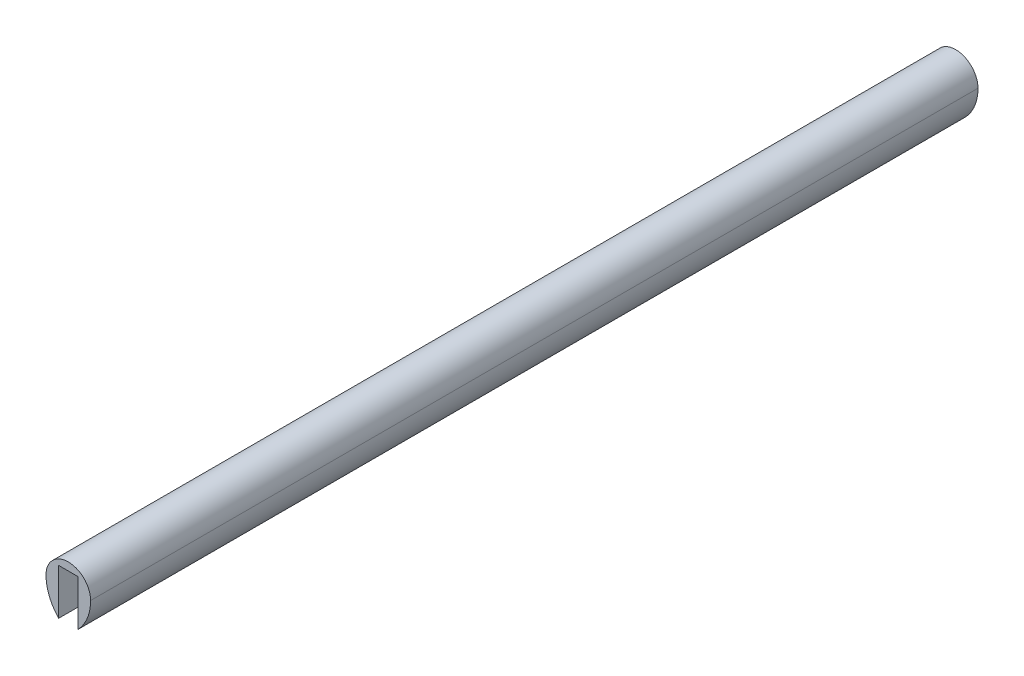
ISO-10303-21;
HEADER;
FILE_DESCRIPTION(('STEP AP214'),'2;1');
FILE_NAME('part.step','',(''),(''),'','','');
FILE_SCHEMA(('AUTOMOTIVE_DESIGN { 1 0 10303 214 1 1 1 1 }'));
ENDSEC;
DATA;
#1=APPLICATION_CONTEXT('core data for automotive mechanical design processes');
#2=APPLICATION_PROTOCOL_DEFINITION('international standard','automotive_design',2000,#1);
#3=PRODUCT_CONTEXT('',#1,'mechanical');
#4=PRODUCT('Part','Part','',(#3));
#5=PRODUCT_RELATED_PRODUCT_CATEGORY('part','',(#4));
#6=PRODUCT_DEFINITION_FORMATION('','',#4);
#7=PRODUCT_DEFINITION_CONTEXT('part definition',#1,'design');
#8=PRODUCT_DEFINITION('design','',#6,#7);
#9=PRODUCT_DEFINITION_SHAPE('','',#8);
#10=(LENGTH_UNIT() NAMED_UNIT(*) SI_UNIT(.MILLI.,.METRE.));
#11=(NAMED_UNIT(*) PLANE_ANGLE_UNIT() SI_UNIT($,.RADIAN.));
#12=(NAMED_UNIT(*) SI_UNIT($,.STERADIAN.) SOLID_ANGLE_UNIT());
#13=UNCERTAINTY_MEASURE_WITH_UNIT(LENGTH_MEASURE(1.E-05),#10,'distance_accuracy_value','');
#14=(GEOMETRIC_REPRESENTATION_CONTEXT(3) GLOBAL_UNCERTAINTY_ASSIGNED_CONTEXT((#13)) GLOBAL_UNIT_ASSIGNED_CONTEXT((#10,
#11,#12)) REPRESENTATION_CONTEXT('',''));
#15=CARTESIAN_POINT('',(0.,0.,0.));
#16=DIRECTION('',(0.,0.,1.));
#17=DIRECTION('',(1.,0.,0.));
#18=AXIS2_PLACEMENT_3D('',#15,#16,#17);
#19=CARTESIAN_POINT('',(-3.175,15.08125,-146.05));
#20=DIRECTION('',(0.,-1.,0.));
#21=DIRECTION('',(0.,0.,-1.));
#22=AXIS2_PLACEMENT_3D('',#19,#20,#21);
#23=PLANE('',#22);
#24=DIRECTION('',(0.,0.,-1.));
#25=VECTOR('',#24,1.);
#26=CARTESIAN_POINT('',(-3.175,15.08125,-146.05));
#27=LINE('',#26,#25);
#28=CARTESIAN_POINT('',(-3.175,15.08125,-146.05));
#29=VERTEX_POINT('',#28);
#30=CARTESIAN_POINT('',(-3.175,15.08125,146.05));
#31=VERTEX_POINT('',#30);
#32=EDGE_CURVE('E114',#29,#31,#27,.F.);
#33=ORIENTED_EDGE('',*,*,#32,.F.);
#34=DIRECTION('',(1.,0.,0.));
#35=VECTOR('',#34,1.);
#36=CARTESIAN_POINT('',(0.,15.08125,-146.05));
#37=LINE('',#36,#35);
#38=CARTESIAN_POINT('',(3.175,15.08125,-146.05));
#39=VERTEX_POINT('',#38);
#40=EDGE_CURVE('E92',#29,#39,#37,.T.);
#41=ORIENTED_EDGE('',*,*,#40,.T.);
#42=DIRECTION('',(0.,0.,1.));
#43=VECTOR('',#42,1.);
#44=CARTESIAN_POINT('',(3.175,15.08125,-146.05));
#45=LINE('',#44,#43);
#46=CARTESIAN_POINT('',(3.175,15.08125,146.05));
#47=VERTEX_POINT('',#46);
#48=EDGE_CURVE('E118',#47,#39,#45,.F.);
#49=ORIENTED_EDGE('',*,*,#48,.F.);
#50=DIRECTION('',(1.,0.,0.));
#51=VECTOR('',#50,1.);
#52=CARTESIAN_POINT('',(0.,15.08125,146.05));
#53=LINE('',#52,#51);
#54=EDGE_CURVE('E108',#31,#47,#53,.T.);
#55=ORIENTED_EDGE('',*,*,#54,.F.);
#56=EDGE_LOOP('',(#33,#41,#49,#55));
#57=FACE_BOUND('',#56,.T.);
#58=ADVANCED_FACE('F17',(#57),#23,.T.);
#59=CARTESIAN_POINT('',(3.175,15.08125,-146.05));
#60=DIRECTION('',(-1.,0.,0.));
#61=DIRECTION('',(0.,0.,1.));
#62=AXIS2_PLACEMENT_3D('',#59,#60,#61);
#63=PLANE('',#62);
#64=DIRECTION('',(0.,1.,0.));
#65=VECTOR('',#64,1.);
#66=CARTESIAN_POINT('',(3.175,0.,-146.05));
#67=LINE('',#66,#65);
#68=CARTESIAN_POINT('',(3.17500000000002,0.,-146.05));
#69=VERTEX_POINT('',#68);
#70=EDGE_CURVE('E89',#39,#69,#67,.F.);
#71=ORIENTED_EDGE('',*,*,#70,.T.);
#72=DIRECTION('',(0.,0.,1.));
#73=VECTOR('',#72,1.);
#74=CARTESIAN_POINT('',(3.17500000000005,0.,146.05));
#75=LINE('',#74,#73);
#76=CARTESIAN_POINT('',(3.17500000000002,0.,146.05));
#77=VERTEX_POINT('',#76);
#78=EDGE_CURVE('E72',#77,#69,#75,.F.);
#79=ORIENTED_EDGE('',*,*,#78,.F.);
#80=DIRECTION('',(0.,1.,0.));
#81=VECTOR('',#80,1.);
#82=CARTESIAN_POINT('',(3.175,0.,146.05));
#83=LINE('',#82,#81);
#84=EDGE_CURVE('E68',#47,#77,#83,.F.);
#85=ORIENTED_EDGE('',*,*,#84,.F.);
#86=ORIENTED_EDGE('',*,*,#48,.T.);
#87=EDGE_LOOP('',(#71,#79,#85,#86));
#88=FACE_BOUND('',#87,.T.);
#89=ADVANCED_FACE('F139',(#88),#63,.T.);
#90=CARTESIAN_POINT('',(-3.175,0.,-146.05));
#91=DIRECTION('',(1.,0.,0.));
#92=DIRECTION('',(0.,0.,-1.));
#93=AXIS2_PLACEMENT_3D('',#90,#91,#92);
#94=PLANE('',#93);
#95=DIRECTION('',(0.,1.,0.));
#96=VECTOR('',#95,1.);
#97=CARTESIAN_POINT('',(-3.175,0.,146.05));
#98=LINE('',#97,#96);
#99=CARTESIAN_POINT('',(-3.17500000000002,0.,146.05));
#100=VERTEX_POINT('',#99);
#101=EDGE_CURVE('E111',#100,#31,#98,.T.);
#102=ORIENTED_EDGE('',*,*,#101,.F.);
#103=DIRECTION('',(0.,0.,-1.));
#104=VECTOR('',#103,1.);
#105=CARTESIAN_POINT('',(-3.17500000000005,0.,146.05));
#106=LINE('',#105,#104);
#107=CARTESIAN_POINT('',(-3.17500000000002,0.,-146.05));
#108=VERTEX_POINT('',#107);
#109=EDGE_CURVE('E88',#108,#100,#106,.F.);
#110=ORIENTED_EDGE('',*,*,#109,.F.);
#111=DIRECTION('',(0.,1.,0.));
#112=VECTOR('',#111,1.);
#113=CARTESIAN_POINT('',(-3.175,0.,-146.05));
#114=LINE('',#113,#112);
#115=EDGE_CURVE('E98',#108,#29,#114,.T.);
#116=ORIENTED_EDGE('',*,*,#115,.T.);
#117=ORIENTED_EDGE('',*,*,#32,.T.);
#118=EDGE_LOOP('',(#102,#110,#116,#117));
#119=FACE_BOUND('',#118,.T.);
#120=ADVANCED_FACE('F184',(#119),#94,.T.);
#121=CARTESIAN_POINT('',(0.,0.,146.05));
#122=DIRECTION('',(0.,0.,1.));
#123=DIRECTION('',(1.,0.,0.));
#124=AXIS2_PLACEMENT_3D('',#121,#122,#123);
#125=PLANE('',#124);
#126=CARTESIAN_POINT('',(0.,10.31875,146.05));
#127=DIRECTION('',(0.,0.,1.));
#128=DIRECTION('',(1.,0.,0.));
#129=AXIS2_PLACEMENT_3D('',#126,#127,#128);
#130=CIRCLE('',#129,7.3421875);
#131=CARTESIAN_POINT('',(-7.3421875,10.31875,146.05));
#132=VERTEX_POINT('',#131);
#133=CARTESIAN_POINT('',(7.3421875,10.31875,146.05));
#134=VERTEX_POINT('',#133);
#135=EDGE_CURVE('E64',#132,#134,#130,.F.);
#136=ORIENTED_EDGE('',*,*,#135,.F.);
#137=CARTESIAN_POINT('',(7.51700148809548,10.31875,146.05));
#138=DIRECTION('',(0.,0.,-1.));
#139=DIRECTION('',(-1.,0.,0.));
#140=AXIS2_PLACEMENT_3D('',#137,#138,#139);
#141=CIRCLE('',#140,14.8591889880955);
#142=EDGE_CURVE('E83',#100,#132,#141,.T.);
#143=ORIENTED_EDGE('',*,*,#142,.F.);
#144=ORIENTED_EDGE('',*,*,#101,.T.);
#145=ORIENTED_EDGE('',*,*,#54,.T.);
#146=ORIENTED_EDGE('',*,*,#84,.T.);
#147=CARTESIAN_POINT('',(-7.51700148809548,10.31875,146.05));
#148=DIRECTION('',(0.,0.,1.));
#149=DIRECTION('',(1.,0.,0.));
#150=AXIS2_PLACEMENT_3D('',#147,#148,#149);
#151=CIRCLE('',#150,14.8591889880955);
#152=EDGE_CURVE('E20',#134,#77,#151,.F.);
#153=ORIENTED_EDGE('',*,*,#152,.F.);
#154=EDGE_LOOP('',(#136,#143,#144,#145,#146,#153));
#155=FACE_BOUND('',#154,.T.);
#156=ADVANCED_FACE('F61',(#155),#125,.T.);
#157=CARTESIAN_POINT('',(-7.51700148809548,10.31875,146.05));
#158=DIRECTION('',(0.,0.,1.));
#159=DIRECTION('',(1.,0.,0.));
#160=AXIS2_PLACEMENT_3D('',#157,#158,#159);
#161=CYLINDRICAL_SURFACE('',#160,14.8591889880955);
#162=ORIENTED_EDGE('',*,*,#78,.T.);
#163=CARTESIAN_POINT('',(-7.51700148809548,10.31875,-146.05));
#164=DIRECTION('',(0.,0.,1.));
#165=DIRECTION('',(1.,0.,0.));
#166=AXIS2_PLACEMENT_3D('',#163,#164,#165);
#167=CIRCLE('',#166,14.8591889880955);
#168=CARTESIAN_POINT('',(7.3421875,10.31875,-146.05));
#169=VERTEX_POINT('',#168);
#170=EDGE_CURVE('E77',#69,#169,#167,.T.);
#171=ORIENTED_EDGE('',*,*,#170,.T.);
#172=DIRECTION('',(0.,0.,1.));
#173=VECTOR('',#172,1.);
#174=CARTESIAN_POINT('',(7.3421875,10.31875,-146.05));
#175=LINE('',#174,#173);
#176=EDGE_CURVE('E74',#134,#169,#175,.F.);
#177=ORIENTED_EDGE('',*,*,#176,.F.);
#178=ORIENTED_EDGE('',*,*,#152,.T.);
#179=EDGE_LOOP('',(#162,#171,#177,#178));
#180=FACE_BOUND('',#179,.T.);
#181=ADVANCED_FACE('F75',(#180),#161,.T.);
#182=CARTESIAN_POINT('',(0.,0.,-146.05));
#183=DIRECTION('',(0.,0.,1.));
#184=DIRECTION('',(1.,0.,0.));
#185=AXIS2_PLACEMENT_3D('',#182,#183,#184);
#186=PLANE('',#185);
#187=ORIENTED_EDGE('',*,*,#170,.F.);
#188=ORIENTED_EDGE('',*,*,#70,.F.);
#189=ORIENTED_EDGE('',*,*,#40,.F.);
#190=ORIENTED_EDGE('',*,*,#115,.F.);
#191=CARTESIAN_POINT('',(7.51700148809548,10.31875,-146.05));
#192=DIRECTION('',(0.,0.,-1.));
#193=DIRECTION('',(-1.,0.,0.));
#194=AXIS2_PLACEMENT_3D('',#191,#192,#193);
#195=CIRCLE('',#194,14.8591889880955);
#196=CARTESIAN_POINT('',(-7.3421875,10.31875,-146.05));
#197=VERTEX_POINT('',#196);
#198=EDGE_CURVE('E35',#197,#108,#195,.F.);
#199=ORIENTED_EDGE('',*,*,#198,.F.);
#200=CARTESIAN_POINT('',(0.,10.31875,-146.05));
#201=DIRECTION('',(0.,0.,1.));
#202=DIRECTION('',(1.,0.,0.));
#203=AXIS2_PLACEMENT_3D('',#200,#201,#202);
#204=CIRCLE('',#203,7.3421875);
#205=EDGE_CURVE('E26',#169,#197,#204,.T.);
#206=ORIENTED_EDGE('',*,*,#205,.F.);
#207=EDGE_LOOP('',(#187,#188,#189,#190,#199,#206));
#208=FACE_BOUND('',#207,.T.);
#209=ADVANCED_FACE('F140',(#208),#186,.F.);
#210=CARTESIAN_POINT('',(7.51700148809548,10.31875,146.05));
#211=DIRECTION('',(0.,0.,-1.));
#212=DIRECTION('',(-1.,0.,0.));
#213=AXIS2_PLACEMENT_3D('',#210,#211,#212);
#214=CYLINDRICAL_SURFACE('',#213,14.8591889880955);
#215=DIRECTION('',(0.,0.,1.));
#216=VECTOR('',#215,1.);
#217=CARTESIAN_POINT('',(-7.3421875,10.31875,-146.05));
#218=LINE('',#217,#216);
#219=EDGE_CURVE('E11',#197,#132,#218,.T.);
#220=ORIENTED_EDGE('',*,*,#219,.F.);
#221=ORIENTED_EDGE('',*,*,#198,.T.);
#222=ORIENTED_EDGE('',*,*,#109,.T.);
#223=ORIENTED_EDGE('',*,*,#142,.T.);
#224=EDGE_LOOP('',(#220,#221,#222,#223));
#225=FACE_BOUND('',#224,.T.);
#226=ADVANCED_FACE('F142',(#225),#214,.T.);
#227=CARTESIAN_POINT('',(0.,10.31875,-146.05));
#228=DIRECTION('',(0.,0.,1.));
#229=DIRECTION('',(1.,0.,0.));
#230=AXIS2_PLACEMENT_3D('',#227,#228,#229);
#231=CYLINDRICAL_SURFACE('',#230,7.3421875);
#232=ORIENTED_EDGE('',*,*,#205,.T.);
#233=ORIENTED_EDGE('',*,*,#219,.T.);
#234=ORIENTED_EDGE('',*,*,#135,.T.);
#235=ORIENTED_EDGE('',*,*,#176,.T.);
#236=EDGE_LOOP('',(#232,#233,#234,#235));
#237=FACE_BOUND('',#236,.T.);
#238=ADVANCED_FACE('F81',(#237),#231,.T.);
#239=CLOSED_SHELL('',(#58,#89,#120,#156,#181,#209,#226,#238));
#240=MANIFOLD_SOLID_BREP('B1',#239);
#241=ADVANCED_BREP_SHAPE_REPRESENTATION('',(#18,#240),#14);
#242=SHAPE_DEFINITION_REPRESENTATION(#9,#241);
ENDSEC;
END-ISO-10303-21;
